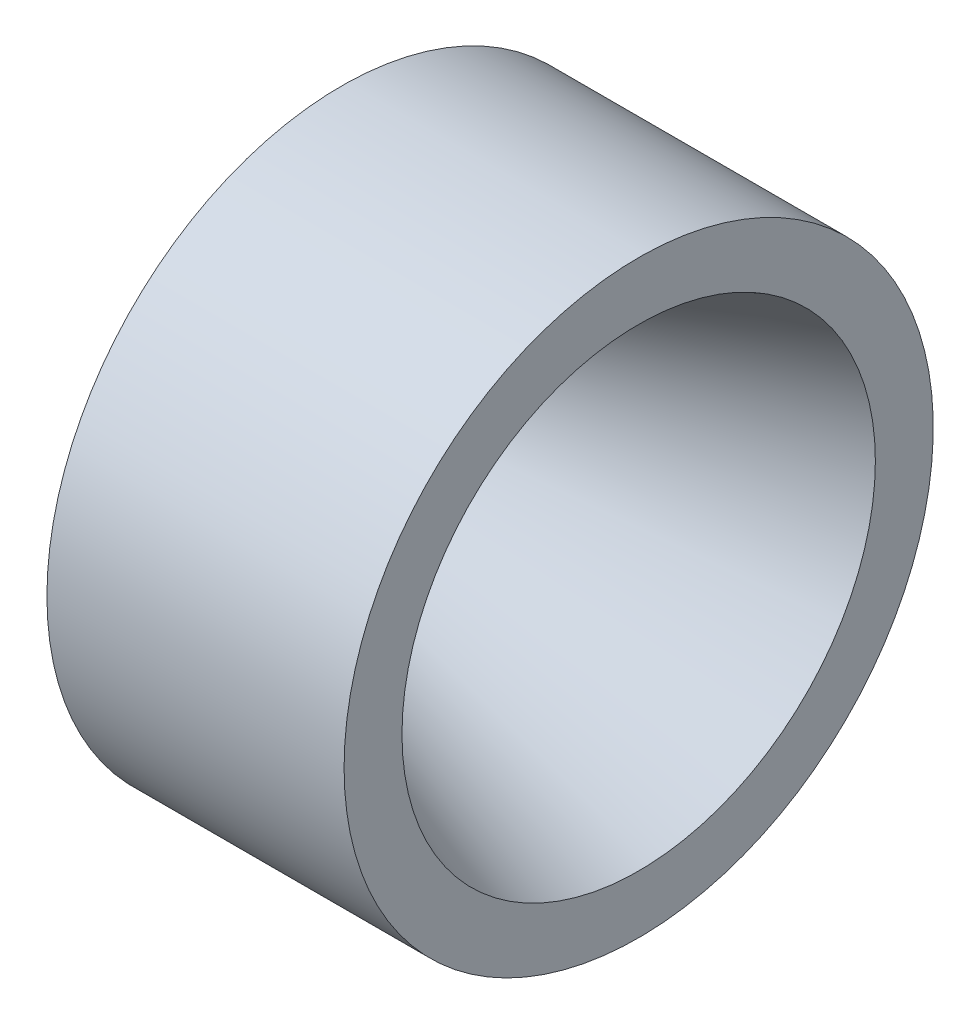
ISO-10303-21;
HEADER;
FILE_DESCRIPTION(('STEP AP214'),'2;1');
FILE_NAME('part.step','',(''),(''),'','','');
FILE_SCHEMA(('AUTOMOTIVE_DESIGN { 1 0 10303 214 1 1 1 1 }'));
ENDSEC;
DATA;
#1=APPLICATION_CONTEXT('core data for automotive mechanical design processes');
#2=APPLICATION_PROTOCOL_DEFINITION('international standard','automotive_design',2000,#1);
#3=PRODUCT_CONTEXT('',#1,'mechanical');
#4=PRODUCT('Part','Part','',(#3));
#5=PRODUCT_RELATED_PRODUCT_CATEGORY('part','',(#4));
#6=PRODUCT_DEFINITION_FORMATION('','',#4);
#7=PRODUCT_DEFINITION_CONTEXT('part definition',#1,'design');
#8=PRODUCT_DEFINITION('design','',#6,#7);
#9=PRODUCT_DEFINITION_SHAPE('','',#8);
#10=(LENGTH_UNIT() NAMED_UNIT(*) SI_UNIT(.MILLI.,.METRE.));
#11=(NAMED_UNIT(*) PLANE_ANGLE_UNIT() SI_UNIT($,.RADIAN.));
#12=(NAMED_UNIT(*) SI_UNIT($,.STERADIAN.) SOLID_ANGLE_UNIT());
#13=UNCERTAINTY_MEASURE_WITH_UNIT(LENGTH_MEASURE(1.E-05),#10,'distance_accuracy_value','');
#14=(GEOMETRIC_REPRESENTATION_CONTEXT(3) GLOBAL_UNCERTAINTY_ASSIGNED_CONTEXT((#13)) GLOBAL_UNIT_ASSIGNED_CONTEXT((#10,
#11,#12)) REPRESENTATION_CONTEXT('',''));
#15=CARTESIAN_POINT('',(0.,0.,0.));
#16=DIRECTION('',(0.,0.,1.));
#17=DIRECTION('',(1.,0.,0.));
#18=AXIS2_PLACEMENT_3D('',#15,#16,#17);
#19=CARTESIAN_POINT('',(280.911030354224,50.8,0.));
#20=DIRECTION('',(1.,0.,0.));
#21=DIRECTION('',(0.,0.,-1.));
#22=AXIS2_PLACEMENT_3D('',#19,#20,#21);
#23=PLANE('',#22);
#24=CARTESIAN_POINT('',(280.911030354224,29.8449999999999,-51.6930563518932));
#25=DIRECTION('',(-1.,0.,0.));
#26=DIRECTION('',(0.,0.86602540378444,0.499999999999998));
#27=AXIS2_PLACEMENT_3D('',#24,#25,#26);
#28=CIRCLE('',#27,2.54);
#29=CARTESIAN_POINT('',(280.911030354224,32.0447045256124,-50.4230563518932));
#30=VERTEX_POINT('',#29);
#31=EDGE_CURVE('E114',#30,#30,#28,.T.);
#32=ORIENTED_EDGE('',*,*,#31,.F.);
#33=EDGE_LOOP('',(#32));
#34=FACE_BOUND('',#33,.T.);
#35=CARTESIAN_POINT('',(280.911030354224,-2.08406521115547E-13,-59.69));
#36=DIRECTION('',(-1.,0.,0.));
#37=DIRECTION('',(0.,1.,0.));
#38=AXIS2_PLACEMENT_3D('',#35,#36,#37);
#39=CIRCLE('',#38,2.54);
#40=CARTESIAN_POINT('',(280.911030354224,2.53999999999979,-59.69));
#41=VERTEX_POINT('',#40);
#42=EDGE_CURVE('E108',#41,#41,#39,.T.);
#43=ORIENTED_EDGE('',*,*,#42,.F.);
#44=EDGE_LOOP('',(#43));
#45=FACE_BOUND('',#44,.T.);
#46=CARTESIAN_POINT('',(280.911030354224,-29.8450000000002,-51.693056351893));
#47=DIRECTION('',(-1.,0.,0.));
#48=DIRECTION('',(0.,0.866025403784436,-0.500000000000004));
#49=AXIS2_PLACEMENT_3D('',#46,#47,#48);
#50=CIRCLE('',#49,2.54);
#51=CARTESIAN_POINT('',(280.911030354224,-27.6452954743878,-52.963056351893));
#52=VERTEX_POINT('',#51);
#53=EDGE_CURVE('E102',#52,#52,#50,.T.);
#54=ORIENTED_EDGE('',*,*,#53,.F.);
#55=EDGE_LOOP('',(#54));
#56=FACE_BOUND('',#55,.T.);
#57=CARTESIAN_POINT('',(280.911030354224,-51.6930563518933,-29.8449999999997));
#58=DIRECTION('',(-1.,0.,0.));
#59=DIRECTION('',(0.,0.499999999999995,-0.866025403784442));
#60=AXIS2_PLACEMENT_3D('',#57,#58,#59);
#61=CIRCLE('',#60,2.54);
#62=CARTESIAN_POINT('',(280.911030354224,-50.4230563518933,-32.0447045256122));
#63=VERTEX_POINT('',#62);
#64=EDGE_CURVE('E96',#63,#63,#61,.T.);
#65=ORIENTED_EDGE('',*,*,#64,.F.);
#66=EDGE_LOOP('',(#65));
#67=FACE_BOUND('',#66,.T.);
#68=CARTESIAN_POINT('',(280.911030354224,-59.69,0.));
#69=DIRECTION('',(-1.,0.,0.));
#70=DIRECTION('',(0.,0.,-1.));
#71=AXIS2_PLACEMENT_3D('',#68,#69,#70);
#72=CIRCLE('',#71,2.54);
#73=CARTESIAN_POINT('',(280.911030354224,-59.69,-2.54));
#74=VERTEX_POINT('',#73);
#75=EDGE_CURVE('E90',#74,#74,#72,.T.);
#76=ORIENTED_EDGE('',*,*,#75,.F.);
#77=EDGE_LOOP('',(#76));
#78=FACE_BOUND('',#77,.T.);
#79=CARTESIAN_POINT('',(280.911030354224,-51.6930563518929,29.8450000000004));
#80=DIRECTION('',(-1.,0.,0.));
#81=DIRECTION('',(0.,-0.500000000000007,-0.866025403784435));
#82=AXIS2_PLACEMENT_3D('',#79,#80,#81);
#83=CIRCLE('',#82,2.54);
#84=CARTESIAN_POINT('',(280.911030354224,-52.9630563518929,27.645295474388));
#85=VERTEX_POINT('',#84);
#86=EDGE_CURVE('E84',#85,#85,#83,.T.);
#87=ORIENTED_EDGE('',*,*,#86,.F.);
#88=EDGE_LOOP('',(#87));
#89=FACE_BOUND('',#88,.T.);
#90=CARTESIAN_POINT('',(280.911030354224,-29.8449999999995,51.6930563518934));
#91=DIRECTION('',(-1.,0.,0.));
#92=DIRECTION('',(0.,-0.866025403784443,-0.499999999999992));
#93=AXIS2_PLACEMENT_3D('',#90,#91,#92);
#94=CIRCLE('',#93,2.54);
#95=CARTESIAN_POINT('',(280.911030354224,-32.044704525612,50.4230563518934));
#96=VERTEX_POINT('',#95);
#97=EDGE_CURVE('E78',#96,#96,#94,.T.);
#98=ORIENTED_EDGE('',*,*,#97,.F.);
#99=EDGE_LOOP('',(#98));
#100=FACE_BOUND('',#99,.T.);
#101=CARTESIAN_POINT('',(280.911030354224,6.2521956334664E-13,59.69));
#102=DIRECTION('',(-1.,0.,0.));
#103=DIRECTION('',(0.,-1.,0.));
#104=AXIS2_PLACEMENT_3D('',#101,#102,#103);
#105=CIRCLE('',#104,2.54);
#106=CARTESIAN_POINT('',(280.911030354224,-2.53999999999938,59.69));
#107=VERTEX_POINT('',#106);
#108=EDGE_CURVE('E71',#107,#107,#105,.T.);
#109=ORIENTED_EDGE('',*,*,#108,.F.);
#110=EDGE_LOOP('',(#109));
#111=FACE_BOUND('',#110,.T.);
#112=CARTESIAN_POINT('',(280.911030354224,29.8450000000006,51.6930563518928));
#113=DIRECTION('',(-1.,0.,0.));
#114=DIRECTION('',(0.,-0.866025403784433,0.50000000000001));
#115=AXIS2_PLACEMENT_3D('',#112,#113,#114);
#116=CIRCLE('',#115,2.54);
#117=CARTESIAN_POINT('',(280.911030354224,27.6452954743881,52.9630563518928));
#118=VERTEX_POINT('',#117);
#119=EDGE_CURVE('E125',#118,#118,#116,.T.);
#120=ORIENTED_EDGE('',*,*,#119,.F.);
#121=EDGE_LOOP('',(#120));
#122=FACE_BOUND('',#121,.T.);
#123=CARTESIAN_POINT('',(280.911030354224,51.6930563518935,29.8449999999993));
#124=DIRECTION('',(-1.,0.,0.));
#125=DIRECTION('',(0.,-0.499999999999989,0.866025403784445));
#126=AXIS2_PLACEMENT_3D('',#123,#124,#125);
#127=CIRCLE('',#126,2.54);
#128=CARTESIAN_POINT('',(280.911030354224,50.4230563518935,32.0447045256118));
#129=VERTEX_POINT('',#128);
#130=EDGE_CURVE('E119',#129,#129,#127,.T.);
#131=ORIENTED_EDGE('',*,*,#130,.F.);
#132=EDGE_LOOP('',(#131));
#133=FACE_BOUND('',#132,.T.);
#134=CARTESIAN_POINT('',(280.911030354224,51.6930563518931,-29.8450000000001));
#135=DIRECTION('',(-1.,0.,0.));
#136=DIRECTION('',(0.,0.500000000000001,0.866025403784438));
#137=AXIS2_PLACEMENT_3D('',#134,#135,#136);
#138=CIRCLE('',#137,2.54);
#139=CARTESIAN_POINT('',(280.911030354224,52.9630563518931,-27.6452954743876));
#140=VERTEX_POINT('',#139);
#141=EDGE_CURVE('E65',#140,#140,#138,.T.);
#142=ORIENTED_EDGE('',*,*,#141,.F.);
#143=EDGE_LOOP('',(#142));
#144=FACE_BOUND('',#143,.T.);
#145=CARTESIAN_POINT('',(280.911030354224,59.69,0.));
#146=DIRECTION('',(-1.,0.,0.));
#147=DIRECTION('',(0.,0.,1.));
#148=AXIS2_PLACEMENT_3D('',#145,#146,#147);
#149=CIRCLE('',#148,2.54);
#150=CARTESIAN_POINT('',(280.911030354224,59.69,2.54));
#151=VERTEX_POINT('',#150);
#152=EDGE_CURVE('E59',#151,#151,#149,.T.);
#153=ORIENTED_EDGE('',*,*,#152,.F.);
#154=EDGE_LOOP('',(#153));
#155=FACE_BOUND('',#154,.T.);
#156=CARTESIAN_POINT('',(280.911030354224,0.,0.));
#157=DIRECTION('',(-1.,0.,0.));
#158=DIRECTION('',(0.,0.,1.));
#159=AXIS2_PLACEMENT_3D('',#156,#157,#158);
#160=CIRCLE('',#159,30.48);
#161=CARTESIAN_POINT('',(280.911030354224,0.,30.48));
#162=VERTEX_POINT('',#161);
#163=EDGE_CURVE('E53',#162,#162,#160,.T.);
#164=ORIENTED_EDGE('',*,*,#163,.F.);
#165=EDGE_LOOP('',(#164));
#166=FACE_BOUND('',#165,.T.);
#167=CARTESIAN_POINT('',(280.911030354224,0.,0.));
#168=DIRECTION('',(-1.,0.,0.));
#169=DIRECTION('',(0.,0.,1.));
#170=AXIS2_PLACEMENT_3D('',#167,#168,#169);
#171=CIRCLE('',#170,69.85);
#172=CARTESIAN_POINT('',(280.911030354224,0.,69.85));
#173=VERTEX_POINT('',#172);
#174=EDGE_CURVE('E10',#173,#173,#171,.T.);
#175=ORIENTED_EDGE('',*,*,#174,.T.);
#176=EDGE_LOOP('',(#175));
#177=FACE_BOUND('',#176,.T.);
#178=ADVANCED_FACE('F39',(#34,#45,#56,#67,#78,#89,#100,#111,#122,#133,#144,#155,#166,#177),#23,.F.);
#179=CARTESIAN_POINT('',(0.,0.,0.));
#180=DIRECTION('',(-1.,0.,0.));
#181=DIRECTION('',(0.,0.,1.));
#182=AXIS2_PLACEMENT_3D('',#179,#180,#181);
#183=CYLINDRICAL_SURFACE('',#182,69.85);
#184=ORIENTED_EDGE('',*,*,#174,.F.);
#185=EDGE_LOOP('',(#184));
#186=FACE_BOUND('',#185,.T.);
#187=CARTESIAN_POINT('',(351.369552102032,0.,0.));
#188=DIRECTION('',(-1.,0.,0.));
#189=DIRECTION('',(0.,0.,1.));
#190=AXIS2_PLACEMENT_3D('',#187,#188,#189);
#191=CIRCLE('',#190,69.85);
#192=CARTESIAN_POINT('',(351.369552102032,0.,69.85));
#193=VERTEX_POINT('',#192);
#194=EDGE_CURVE('E45',#193,#193,#191,.T.);
#195=ORIENTED_EDGE('',*,*,#194,.T.);
#196=EDGE_LOOP('',(#195));
#197=FACE_BOUND('',#196,.T.);
#198=ADVANCED_FACE('F142',(#186,#197),#183,.T.);
#199=CARTESIAN_POINT('',(351.369552102032,56.1248046666,0.));
#200=DIRECTION('',(-1.,0.,0.));
#201=DIRECTION('',(0.,0.,1.));
#202=AXIS2_PLACEMENT_3D('',#199,#200,#201);
#203=PLANE('',#202);
#204=ORIENTED_EDGE('',*,*,#194,.F.);
#205=EDGE_LOOP('',(#204));
#206=FACE_BOUND('',#205,.T.);
#207=CARTESIAN_POINT('',(351.369552102032,0.,0.));
#208=DIRECTION('',(-1.,0.,0.));
#209=DIRECTION('',(0.,0.,1.));
#210=AXIS2_PLACEMENT_3D('',#207,#208,#209);
#211=CIRCLE('',#210,56.1248046666);
#212=CARTESIAN_POINT('',(351.369552102032,0.,56.1248046666));
#213=VERTEX_POINT('',#212);
#214=EDGE_CURVE('E49',#213,#213,#211,.T.);
#215=ORIENTED_EDGE('',*,*,#214,.T.);
#216=EDGE_LOOP('',(#215));
#217=FACE_BOUND('',#216,.T.);
#218=ADVANCED_FACE('F155',(#206,#217),#203,.F.);
#219=CARTESIAN_POINT('',(280.911030354224,0.,0.));
#220=DIRECTION('',(1.,0.,0.));
#221=DIRECTION('',(0.,0.,-1.));
#222=AXIS2_PLACEMENT_3D('',#219,#220,#221);
#223=CONICAL_SURFACE('',#222,30.48,0.349065850398867);
#224=ORIENTED_EDGE('',*,*,#214,.F.);
#225=EDGE_LOOP('',(#224));
#226=FACE_BOUND('',#225,.T.);
#227=ORIENTED_EDGE('',*,*,#163,.T.);
#228=EDGE_LOOP('',(#227));
#229=FACE_BOUND('',#228,.T.);
#230=ADVANCED_FACE('F152',(#226,#229),#223,.F.);
#231=CARTESIAN_POINT('',(311.391030354224,59.69,0.));
#232=DIRECTION('',(-1.,0.,0.));
#233=DIRECTION('',(0.,0.,1.));
#234=AXIS2_PLACEMENT_3D('',#231,#232,#233);
#235=CYLINDRICAL_SURFACE('',#234,2.54);
#236=CARTESIAN_POINT('',(311.391030354224,59.69,0.));
#237=DIRECTION('',(-1.,0.,0.));
#238=DIRECTION('',(0.,0.,1.));
#239=AXIS2_PLACEMENT_3D('',#236,#237,#238);
#240=CIRCLE('',#239,2.54);
#241=CARTESIAN_POINT('',(311.391030354224,59.69,2.54));
#242=VERTEX_POINT('',#241);
#243=EDGE_CURVE('E58',#242,#242,#240,.T.);
#244=ORIENTED_EDGE('',*,*,#243,.F.);
#245=EDGE_LOOP('',(#244));
#246=FACE_BOUND('',#245,.T.);
#247=ORIENTED_EDGE('',*,*,#152,.T.);
#248=EDGE_LOOP('',(#247));
#249=FACE_BOUND('',#248,.T.);
#250=ADVANCED_FACE('F154',(#246,#249),#235,.F.);
#251=CARTESIAN_POINT('',(311.391030354224,0.,0.));
#252=DIRECTION('',(-1.,0.,0.));
#253=DIRECTION('',(0.,0.,1.));
#254=AXIS2_PLACEMENT_3D('',#251,#252,#253);
#255=PLANE('',#254);
#256=ORIENTED_EDGE('',*,*,#243,.T.);
#257=EDGE_LOOP('',(#256));
#258=FACE_BOUND('',#257,.T.);
#259=ADVANCED_FACE('F162',(#258),#255,.T.);
#260=CARTESIAN_POINT('',(311.391030354224,51.6930563518931,-29.8450000000001));
#261=DIRECTION('',(-1.,0.,0.));
#262=DIRECTION('',(0.,0.,1.));
#263=AXIS2_PLACEMENT_3D('',#260,#261,#262);
#264=CYLINDRICAL_SURFACE('',#263,2.54);
#265=CARTESIAN_POINT('',(311.391030354224,51.6930563518931,-29.8450000000001));
#266=DIRECTION('',(-1.,0.,0.));
#267=DIRECTION('',(0.,0.500000000000001,0.866025403784438));
#268=AXIS2_PLACEMENT_3D('',#265,#266,#267);
#269=CIRCLE('',#268,2.54);
#270=CARTESIAN_POINT('',(311.391030354224,52.9630563518931,-27.6452954743876));
#271=VERTEX_POINT('',#270);
#272=EDGE_CURVE('E62',#271,#271,#269,.T.);
#273=ORIENTED_EDGE('',*,*,#272,.F.);
#274=EDGE_LOOP('',(#273));
#275=FACE_BOUND('',#274,.T.);
#276=ORIENTED_EDGE('',*,*,#141,.T.);
#277=EDGE_LOOP('',(#276));
#278=FACE_BOUND('',#277,.T.);
#279=ADVANCED_FACE('F197',(#275,#278),#264,.F.);
#280=CARTESIAN_POINT('',(311.391030354224,0.,0.));
#281=DIRECTION('',(-1.,0.,0.));
#282=DIRECTION('',(0.,0.500000000000001,0.866025403784438));
#283=AXIS2_PLACEMENT_3D('',#280,#281,#282);
#284=PLANE('',#283);
#285=ORIENTED_EDGE('',*,*,#272,.T.);
#286=EDGE_LOOP('',(#285));
#287=FACE_BOUND('',#286,.T.);
#288=ADVANCED_FACE('F212',(#287),#284,.T.);
#289=CARTESIAN_POINT('',(311.391030354224,51.6930563518935,29.8449999999993));
#290=DIRECTION('',(-1.,0.,0.));
#291=DIRECTION('',(0.,0.,1.));
#292=AXIS2_PLACEMENT_3D('',#289,#290,#291);
#293=CYLINDRICAL_SURFACE('',#292,2.54);
#294=CARTESIAN_POINT('',(311.391030354224,51.6930563518935,29.8449999999993));
#295=DIRECTION('',(-1.,0.,0.));
#296=DIRECTION('',(0.,-0.499999999999989,0.866025403784445));
#297=AXIS2_PLACEMENT_3D('',#294,#295,#296);
#298=CIRCLE('',#297,2.54);
#299=CARTESIAN_POINT('',(311.391030354224,50.4230563518935,32.0447045256118));
#300=VERTEX_POINT('',#299);
#301=EDGE_CURVE('E122',#300,#300,#298,.T.);
#302=ORIENTED_EDGE('',*,*,#301,.F.);
#303=EDGE_LOOP('',(#302));
#304=FACE_BOUND('',#303,.T.);
#305=ORIENTED_EDGE('',*,*,#130,.T.);
#306=EDGE_LOOP('',(#305));
#307=FACE_BOUND('',#306,.T.);
#308=ADVANCED_FACE('F222',(#304,#307),#293,.F.);
#309=CARTESIAN_POINT('',(311.391030354224,0.,0.));
#310=DIRECTION('',(-1.,0.,0.));
#311=DIRECTION('',(0.,-0.499999999999989,0.866025403784445));
#312=AXIS2_PLACEMENT_3D('',#309,#310,#311);
#313=PLANE('',#312);
#314=ORIENTED_EDGE('',*,*,#301,.T.);
#315=EDGE_LOOP('',(#314));
#316=FACE_BOUND('',#315,.T.);
#317=ADVANCED_FACE('F136',(#316),#313,.T.);
#318=CARTESIAN_POINT('',(311.391030354224,29.8450000000006,51.6930563518928));
#319=DIRECTION('',(-1.,0.,0.));
#320=DIRECTION('',(0.,0.,1.));
#321=AXIS2_PLACEMENT_3D('',#318,#319,#320);
#322=CYLINDRICAL_SURFACE('',#321,2.54);
#323=CARTESIAN_POINT('',(311.391030354224,29.8450000000006,51.6930563518928));
#324=DIRECTION('',(-1.,0.,0.));
#325=DIRECTION('',(0.,-0.866025403784433,0.50000000000001));
#326=AXIS2_PLACEMENT_3D('',#323,#324,#325);
#327=CIRCLE('',#326,2.54);
#328=CARTESIAN_POINT('',(311.391030354224,27.6452954743881,52.9630563518928));
#329=VERTEX_POINT('',#328);
#330=EDGE_CURVE('E75',#329,#329,#327,.T.);
#331=ORIENTED_EDGE('',*,*,#330,.F.);
#332=EDGE_LOOP('',(#331));
#333=FACE_BOUND('',#332,.T.);
#334=ORIENTED_EDGE('',*,*,#119,.T.);
#335=EDGE_LOOP('',(#334));
#336=FACE_BOUND('',#335,.T.);
#337=ADVANCED_FACE('F133',(#333,#336),#322,.F.);
#338=CARTESIAN_POINT('',(311.391030354224,0.,0.));
#339=DIRECTION('',(-1.,0.,0.));
#340=DIRECTION('',(0.,-0.866025403784433,0.50000000000001));
#341=AXIS2_PLACEMENT_3D('',#338,#339,#340);
#342=PLANE('',#341);
#343=ORIENTED_EDGE('',*,*,#330,.T.);
#344=EDGE_LOOP('',(#343));
#345=FACE_BOUND('',#344,.T.);
#346=ADVANCED_FACE('F131',(#345),#342,.T.);
#347=CARTESIAN_POINT('',(311.391030354224,6.2521956334664E-13,59.69));
#348=DIRECTION('',(-1.,0.,0.));
#349=DIRECTION('',(0.,0.,1.));
#350=AXIS2_PLACEMENT_3D('',#347,#348,#349);
#351=CYLINDRICAL_SURFACE('',#350,2.54);
#352=CARTESIAN_POINT('',(311.391030354224,6.2521956334664E-13,59.69));
#353=DIRECTION('',(-1.,0.,0.));
#354=DIRECTION('',(0.,-1.,0.));
#355=AXIS2_PLACEMENT_3D('',#352,#353,#354);
#356=CIRCLE('',#355,2.54);
#357=CARTESIAN_POINT('',(311.391030354224,-2.53999999999938,59.69));
#358=VERTEX_POINT('',#357);
#359=EDGE_CURVE('E74',#358,#358,#356,.T.);
#360=ORIENTED_EDGE('',*,*,#359,.F.);
#361=EDGE_LOOP('',(#360));
#362=FACE_BOUND('',#361,.T.);
#363=ORIENTED_EDGE('',*,*,#108,.T.);
#364=EDGE_LOOP('',(#363));
#365=FACE_BOUND('',#364,.T.);
#366=ADVANCED_FACE('F256',(#362,#365),#351,.F.);
#367=CARTESIAN_POINT('',(311.391030354224,0.,0.));
#368=DIRECTION('',(-1.,0.,0.));
#369=DIRECTION('',(0.,-1.,0.));
#370=AXIS2_PLACEMENT_3D('',#367,#368,#369);
#371=PLANE('',#370);
#372=ORIENTED_EDGE('',*,*,#359,.T.);
#373=EDGE_LOOP('',(#372));
#374=FACE_BOUND('',#373,.T.);
#375=ADVANCED_FACE('F265',(#374),#371,.T.);
#376=CARTESIAN_POINT('',(311.391030354224,-29.8449999999995,51.6930563518934));
#377=DIRECTION('',(-1.,0.,0.));
#378=DIRECTION('',(0.,0.,1.));
#379=AXIS2_PLACEMENT_3D('',#376,#377,#378);
#380=CYLINDRICAL_SURFACE('',#379,2.54);
#381=CARTESIAN_POINT('',(311.391030354224,-29.8449999999995,51.6930563518934));
#382=DIRECTION('',(-1.,0.,0.));
#383=DIRECTION('',(0.,-0.866025403784443,-0.499999999999992));
#384=AXIS2_PLACEMENT_3D('',#381,#382,#383);
#385=CIRCLE('',#384,2.54);
#386=CARTESIAN_POINT('',(311.391030354224,-32.044704525612,50.4230563518934));
#387=VERTEX_POINT('',#386);
#388=EDGE_CURVE('E81',#387,#387,#385,.T.);
#389=ORIENTED_EDGE('',*,*,#388,.F.);
#390=EDGE_LOOP('',(#389));
#391=FACE_BOUND('',#390,.T.);
#392=ORIENTED_EDGE('',*,*,#97,.T.);
#393=EDGE_LOOP('',(#392));
#394=FACE_BOUND('',#393,.T.);
#395=ADVANCED_FACE('F275',(#391,#394),#380,.F.);
#396=CARTESIAN_POINT('',(311.391030354224,0.,0.));
#397=DIRECTION('',(-1.,0.,0.));
#398=DIRECTION('',(0.,-0.866025403784443,-0.499999999999992));
#399=AXIS2_PLACEMENT_3D('',#396,#397,#398);
#400=PLANE('',#399);
#401=ORIENTED_EDGE('',*,*,#388,.T.);
#402=EDGE_LOOP('',(#401));
#403=FACE_BOUND('',#402,.T.);
#404=ADVANCED_FACE('F285',(#403),#400,.T.);
#405=CARTESIAN_POINT('',(311.391030354224,-51.6930563518929,29.8450000000004));
#406=DIRECTION('',(-1.,0.,0.));
#407=DIRECTION('',(0.,0.,1.));
#408=AXIS2_PLACEMENT_3D('',#405,#406,#407);
#409=CYLINDRICAL_SURFACE('',#408,2.54);
#410=CARTESIAN_POINT('',(311.391030354224,-51.6930563518929,29.8450000000004));
#411=DIRECTION('',(-1.,0.,0.));
#412=DIRECTION('',(0.,-0.500000000000007,-0.866025403784435));
#413=AXIS2_PLACEMENT_3D('',#410,#411,#412);
#414=CIRCLE('',#413,2.54);
#415=CARTESIAN_POINT('',(311.391030354224,-52.9630563518929,27.645295474388));
#416=VERTEX_POINT('',#415);
#417=EDGE_CURVE('E87',#416,#416,#414,.T.);
#418=ORIENTED_EDGE('',*,*,#417,.F.);
#419=EDGE_LOOP('',(#418));
#420=FACE_BOUND('',#419,.T.);
#421=ORIENTED_EDGE('',*,*,#86,.T.);
#422=EDGE_LOOP('',(#421));
#423=FACE_BOUND('',#422,.T.);
#424=ADVANCED_FACE('F295',(#420,#423),#409,.F.);
#425=CARTESIAN_POINT('',(311.391030354224,0.,0.));
#426=DIRECTION('',(-1.,0.,0.));
#427=DIRECTION('',(0.,-0.500000000000007,-0.866025403784435));
#428=AXIS2_PLACEMENT_3D('',#425,#426,#427);
#429=PLANE('',#428);
#430=ORIENTED_EDGE('',*,*,#417,.T.);
#431=EDGE_LOOP('',(#430));
#432=FACE_BOUND('',#431,.T.);
#433=ADVANCED_FACE('F305',(#432),#429,.T.);
#434=CARTESIAN_POINT('',(311.391030354224,-59.69,0.));
#435=DIRECTION('',(-1.,0.,0.));
#436=DIRECTION('',(0.,0.,1.));
#437=AXIS2_PLACEMENT_3D('',#434,#435,#436);
#438=CYLINDRICAL_SURFACE('',#437,2.54);
#439=CARTESIAN_POINT('',(311.391030354224,-59.69,0.));
#440=DIRECTION('',(-1.,0.,0.));
#441=DIRECTION('',(0.,0.,-1.));
#442=AXIS2_PLACEMENT_3D('',#439,#440,#441);
#443=CIRCLE('',#442,2.54);
#444=CARTESIAN_POINT('',(311.391030354224,-59.69,-2.54));
#445=VERTEX_POINT('',#444);
#446=EDGE_CURVE('E93',#445,#445,#443,.T.);
#447=ORIENTED_EDGE('',*,*,#446,.F.);
#448=EDGE_LOOP('',(#447));
#449=FACE_BOUND('',#448,.T.);
#450=ORIENTED_EDGE('',*,*,#75,.T.);
#451=EDGE_LOOP('',(#450));
#452=FACE_BOUND('',#451,.T.);
#453=ADVANCED_FACE('F315',(#449,#452),#438,.F.);
#454=CARTESIAN_POINT('',(311.391030354224,0.,0.));
#455=DIRECTION('',(-1.,0.,0.));
#456=DIRECTION('',(0.,0.,-1.));
#457=AXIS2_PLACEMENT_3D('',#454,#455,#456);
#458=PLANE('',#457);
#459=ORIENTED_EDGE('',*,*,#446,.T.);
#460=EDGE_LOOP('',(#459));
#461=FACE_BOUND('',#460,.T.);
#462=ADVANCED_FACE('F325',(#461),#458,.T.);
#463=CARTESIAN_POINT('',(311.391030354224,-51.6930563518933,-29.8449999999997));
#464=DIRECTION('',(-1.,0.,0.));
#465=DIRECTION('',(0.,0.,1.));
#466=AXIS2_PLACEMENT_3D('',#463,#464,#465);
#467=CYLINDRICAL_SURFACE('',#466,2.54);
#468=CARTESIAN_POINT('',(311.391030354224,-51.6930563518933,-29.8449999999997));
#469=DIRECTION('',(-1.,0.,0.));
#470=DIRECTION('',(0.,0.499999999999995,-0.866025403784442));
#471=AXIS2_PLACEMENT_3D('',#468,#469,#470);
#472=CIRCLE('',#471,2.54);
#473=CARTESIAN_POINT('',(311.391030354224,-50.4230563518933,-32.0447045256122));
#474=VERTEX_POINT('',#473);
#475=EDGE_CURVE('E99',#474,#474,#472,.T.);
#476=ORIENTED_EDGE('',*,*,#475,.F.);
#477=EDGE_LOOP('',(#476));
#478=FACE_BOUND('',#477,.T.);
#479=ORIENTED_EDGE('',*,*,#64,.T.);
#480=EDGE_LOOP('',(#479));
#481=FACE_BOUND('',#480,.T.);
#482=ADVANCED_FACE('F335',(#478,#481),#467,.F.);
#483=CARTESIAN_POINT('',(311.391030354224,0.,0.));
#484=DIRECTION('',(-1.,0.,0.));
#485=DIRECTION('',(0.,0.499999999999995,-0.866025403784442));
#486=AXIS2_PLACEMENT_3D('',#483,#484,#485);
#487=PLANE('',#486);
#488=ORIENTED_EDGE('',*,*,#475,.T.);
#489=EDGE_LOOP('',(#488));
#490=FACE_BOUND('',#489,.T.);
#491=ADVANCED_FACE('F345',(#490),#487,.T.);
#492=CARTESIAN_POINT('',(311.391030354224,-29.8450000000002,-51.693056351893));
#493=DIRECTION('',(-1.,0.,0.));
#494=DIRECTION('',(0.,0.,1.));
#495=AXIS2_PLACEMENT_3D('',#492,#493,#494);
#496=CYLINDRICAL_SURFACE('',#495,2.54);
#497=CARTESIAN_POINT('',(311.391030354224,-29.8450000000002,-51.693056351893));
#498=DIRECTION('',(-1.,0.,0.));
#499=DIRECTION('',(0.,0.866025403784436,-0.500000000000004));
#500=AXIS2_PLACEMENT_3D('',#497,#498,#499);
#501=CIRCLE('',#500,2.54);
#502=CARTESIAN_POINT('',(311.391030354224,-27.6452954743878,-52.963056351893));
#503=VERTEX_POINT('',#502);
#504=EDGE_CURVE('E105',#503,#503,#501,.T.);
#505=ORIENTED_EDGE('',*,*,#504,.F.);
#506=EDGE_LOOP('',(#505));
#507=FACE_BOUND('',#506,.T.);
#508=ORIENTED_EDGE('',*,*,#53,.T.);
#509=EDGE_LOOP('',(#508));
#510=FACE_BOUND('',#509,.T.);
#511=ADVANCED_FACE('F355',(#507,#510),#496,.F.);
#512=CARTESIAN_POINT('',(311.391030354224,0.,0.));
#513=DIRECTION('',(-1.,0.,0.));
#514=DIRECTION('',(0.,0.866025403784436,-0.500000000000004));
#515=AXIS2_PLACEMENT_3D('',#512,#513,#514);
#516=PLANE('',#515);
#517=ORIENTED_EDGE('',*,*,#504,.T.);
#518=EDGE_LOOP('',(#517));
#519=FACE_BOUND('',#518,.T.);
#520=ADVANCED_FACE('F365',(#519),#516,.T.);
#521=CARTESIAN_POINT('',(311.391030354224,-2.08406521115547E-13,-59.69));
#522=DIRECTION('',(-1.,0.,0.));
#523=DIRECTION('',(0.,0.,1.));
#524=AXIS2_PLACEMENT_3D('',#521,#522,#523);
#525=CYLINDRICAL_SURFACE('',#524,2.54);
#526=CARTESIAN_POINT('',(311.391030354224,-2.08406521115547E-13,-59.69));
#527=DIRECTION('',(-1.,0.,0.));
#528=DIRECTION('',(0.,1.,0.));
#529=AXIS2_PLACEMENT_3D('',#526,#527,#528);
#530=CIRCLE('',#529,2.54);
#531=CARTESIAN_POINT('',(311.391030354224,2.53999999999979,-59.69));
#532=VERTEX_POINT('',#531);
#533=EDGE_CURVE('E111',#532,#532,#530,.T.);
#534=ORIENTED_EDGE('',*,*,#533,.F.);
#535=EDGE_LOOP('',(#534));
#536=FACE_BOUND('',#535,.T.);
#537=ORIENTED_EDGE('',*,*,#42,.T.);
#538=EDGE_LOOP('',(#537));
#539=FACE_BOUND('',#538,.T.);
#540=ADVANCED_FACE('F375',(#536,#539),#525,.F.);
#541=CARTESIAN_POINT('',(311.391030354224,0.,0.));
#542=DIRECTION('',(-1.,0.,0.));
#543=DIRECTION('',(0.,1.,0.));
#544=AXIS2_PLACEMENT_3D('',#541,#542,#543);
#545=PLANE('',#544);
#546=ORIENTED_EDGE('',*,*,#533,.T.);
#547=EDGE_LOOP('',(#546));
#548=FACE_BOUND('',#547,.T.);
#549=ADVANCED_FACE('F385',(#548),#545,.T.);
#550=CARTESIAN_POINT('',(311.391030354224,29.8449999999999,-51.6930563518932));
#551=DIRECTION('',(-1.,0.,0.));
#552=DIRECTION('',(0.,0.,1.));
#553=AXIS2_PLACEMENT_3D('',#550,#551,#552);
#554=CYLINDRICAL_SURFACE('',#553,2.54);
#555=CARTESIAN_POINT('',(311.391030354224,29.8449999999999,-51.6930563518932));
#556=DIRECTION('',(-1.,0.,0.));
#557=DIRECTION('',(0.,0.86602540378444,0.499999999999998));
#558=AXIS2_PLACEMENT_3D('',#555,#556,#557);
#559=CIRCLE('',#558,2.54);
#560=CARTESIAN_POINT('',(311.391030354224,32.0447045256124,-50.4230563518932));
#561=VERTEX_POINT('',#560);
#562=EDGE_CURVE('E68',#561,#561,#559,.T.);
#563=ORIENTED_EDGE('',*,*,#562,.F.);
#564=EDGE_LOOP('',(#563));
#565=FACE_BOUND('',#564,.T.);
#566=ORIENTED_EDGE('',*,*,#31,.T.);
#567=EDGE_LOOP('',(#566));
#568=FACE_BOUND('',#567,.T.);
#569=ADVANCED_FACE('F395',(#565,#568),#554,.F.);
#570=CARTESIAN_POINT('',(311.391030354224,0.,0.));
#571=DIRECTION('',(-1.,0.,0.));
#572=DIRECTION('',(0.,0.86602540378444,0.499999999999998));
#573=AXIS2_PLACEMENT_3D('',#570,#571,#572);
#574=PLANE('',#573);
#575=ORIENTED_EDGE('',*,*,#562,.T.);
#576=EDGE_LOOP('',(#575));
#577=FACE_BOUND('',#576,.T.);
#578=ADVANCED_FACE('F405',(#577),#574,.T.);
#579=CLOSED_SHELL('',(#178,#198,#218,#230,#250,#259,#279,#288,#308,#317,#337,#346,#366,#375,
#395,#404,#424,#433,#453,#462,#482,#491,#511,#520,#540,#549,#569,#578));
#580=MANIFOLD_SOLID_BREP('B2',#579);
#581=ADVANCED_BREP_SHAPE_REPRESENTATION('',(#18,#580),#14);
#582=SHAPE_DEFINITION_REPRESENTATION(#9,#581);
ENDSEC;
END-ISO-10303-21;
